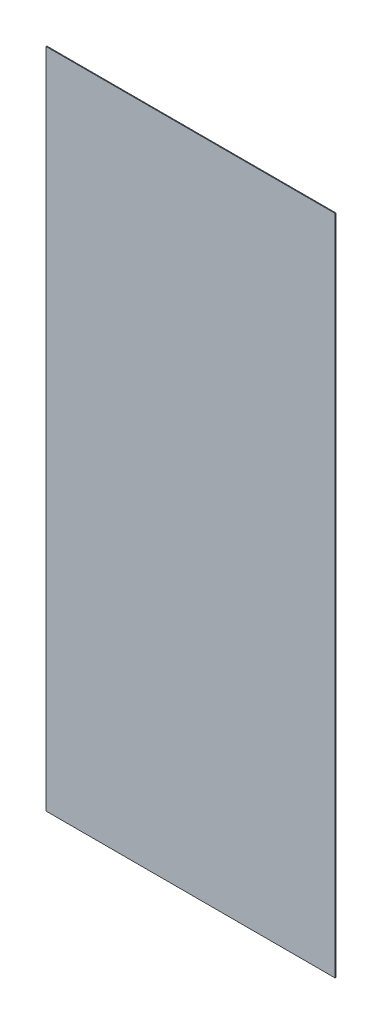
ISO-10303-21;
HEADER;
FILE_DESCRIPTION(('STEP AP214'),'2;1');
FILE_NAME('part.step','',(''),(''),'','','');
FILE_SCHEMA(('AUTOMOTIVE_DESIGN { 1 0 10303 214 1 1 1 1 }'));
ENDSEC;
DATA;
#1=APPLICATION_CONTEXT('core data for automotive mechanical design processes');
#2=APPLICATION_PROTOCOL_DEFINITION('international standard','automotive_design',2000,#1);
#3=PRODUCT_CONTEXT('',#1,'mechanical');
#4=PRODUCT('Part','Part','',(#3));
#5=PRODUCT_RELATED_PRODUCT_CATEGORY('part','',(#4));
#6=PRODUCT_DEFINITION_FORMATION('','',#4);
#7=PRODUCT_DEFINITION_CONTEXT('part definition',#1,'design');
#8=PRODUCT_DEFINITION('design','',#6,#7);
#9=PRODUCT_DEFINITION_SHAPE('','',#8);
#10=(LENGTH_UNIT() NAMED_UNIT(*) SI_UNIT(.MILLI.,.METRE.));
#11=(NAMED_UNIT(*) PLANE_ANGLE_UNIT() SI_UNIT($,.RADIAN.));
#12=(NAMED_UNIT(*) SI_UNIT($,.STERADIAN.) SOLID_ANGLE_UNIT());
#13=UNCERTAINTY_MEASURE_WITH_UNIT(LENGTH_MEASURE(1.E-05),#10,'distance_accuracy_value','');
#14=(GEOMETRIC_REPRESENTATION_CONTEXT(3) GLOBAL_UNCERTAINTY_ASSIGNED_CONTEXT((#13)) GLOBAL_UNIT_ASSIGNED_CONTEXT((#10,
#11,#12)) REPRESENTATION_CONTEXT('',''));
#15=CARTESIAN_POINT('',(0.,0.,0.));
#16=DIRECTION('',(0.,0.,1.));
#17=DIRECTION('',(1.,0.,0.));
#18=AXIS2_PLACEMENT_3D('',#15,#16,#17);
#19=CARTESIAN_POINT('',(0.,0.,1.));
#20=DIRECTION('',(1.,0.,0.));
#21=DIRECTION('',(0.,0.,-1.));
#22=AXIS2_PLACEMENT_3D('',#19,#20,#21);
#23=PLANE('',#22);
#24=DIRECTION('',(0.,-1.,0.));
#25=VECTOR('',#24,1.);
#26=CARTESIAN_POINT('',(0.,0.,0.));
#27=LINE('',#26,#25);
#28=CARTESIAN_POINT('',(0.,820.,0.));
#29=VERTEX_POINT('',#28);
#30=CARTESIAN_POINT('',(0.,0.,0.));
#31=VERTEX_POINT('',#30);
#32=EDGE_CURVE('E95',#29,#31,#27,.T.);
#33=ORIENTED_EDGE('',*,*,#32,.T.);
#34=DIRECTION('',(0.,0.,-1.));
#35=VECTOR('',#34,1.);
#36=CARTESIAN_POINT('',(0.,0.,1.));
#37=LINE('',#36,#35);
#38=CARTESIAN_POINT('',(0.,0.,1.));
#39=VERTEX_POINT('',#38);
#40=EDGE_CURVE('E11',#39,#31,#37,.T.);
#41=ORIENTED_EDGE('',*,*,#40,.F.);
#42=DIRECTION('',(0.,-1.,0.));
#43=VECTOR('',#42,1.);
#44=CARTESIAN_POINT('',(0.,0.,1.));
#45=LINE('',#44,#43);
#46=CARTESIAN_POINT('',(0.,820.,1.));
#47=VERTEX_POINT('',#46);
#48=EDGE_CURVE('E83',#47,#39,#45,.T.);
#49=ORIENTED_EDGE('',*,*,#48,.F.);
#50=DIRECTION('',(0.,0.,-1.));
#51=VECTOR('',#50,1.);
#52=CARTESIAN_POINT('',(0.,820.,1.));
#53=LINE('',#52,#51);
#54=EDGE_CURVE('E91',#47,#29,#53,.T.);
#55=ORIENTED_EDGE('',*,*,#54,.T.);
#56=EDGE_LOOP('',(#33,#41,#49,#55));
#57=FACE_BOUND('',#56,.T.);
#58=ADVANCED_FACE('F32',(#57),#23,.F.);
#59=CARTESIAN_POINT('',(0.,0.,1.));
#60=DIRECTION('',(0.,1.,0.));
#61=DIRECTION('',(0.,0.,1.));
#62=AXIS2_PLACEMENT_3D('',#59,#60,#61);
#63=PLANE('',#62);
#64=DIRECTION('',(1.,0.,0.));
#65=VECTOR('',#64,1.);
#66=CARTESIAN_POINT('',(0.,0.,0.));
#67=LINE('',#66,#65);
#68=CARTESIAN_POINT('',(358.,0.,0.));
#69=VERTEX_POINT('',#68);
#70=EDGE_CURVE('E87',#31,#69,#67,.T.);
#71=ORIENTED_EDGE('',*,*,#70,.T.);
#72=DIRECTION('',(0.,0.,-1.));
#73=VECTOR('',#72,1.);
#74=CARTESIAN_POINT('',(358.,0.,1.));
#75=LINE('',#74,#73);
#76=CARTESIAN_POINT('',(358.,0.,1.));
#77=VERTEX_POINT('',#76);
#78=EDGE_CURVE('E40',#77,#69,#75,.T.);
#79=ORIENTED_EDGE('',*,*,#78,.F.);
#80=DIRECTION('',(1.,0.,0.));
#81=VECTOR('',#80,1.);
#82=CARTESIAN_POINT('',(0.,0.,1.));
#83=LINE('',#82,#81);
#84=EDGE_CURVE('E78',#39,#77,#83,.T.);
#85=ORIENTED_EDGE('',*,*,#84,.F.);
#86=ORIENTED_EDGE('',*,*,#40,.T.);
#87=EDGE_LOOP('',(#71,#79,#85,#86));
#88=FACE_BOUND('',#87,.T.);
#89=ADVANCED_FACE('F86',(#88),#63,.F.);
#90=CARTESIAN_POINT('',(358.,0.,1.));
#91=DIRECTION('',(-1.,0.,0.));
#92=DIRECTION('',(0.,0.,1.));
#93=AXIS2_PLACEMENT_3D('',#90,#91,#92);
#94=PLANE('',#93);
#95=DIRECTION('',(0.,1.,0.));
#96=VECTOR('',#95,1.);
#97=CARTESIAN_POINT('',(358.,0.,0.));
#98=LINE('',#97,#96);
#99=CARTESIAN_POINT('',(358.,820.,0.));
#100=VERTEX_POINT('',#99);
#101=EDGE_CURVE('E65',#69,#100,#98,.T.);
#102=ORIENTED_EDGE('',*,*,#101,.T.);
#103=DIRECTION('',(0.,0.,-1.));
#104=VECTOR('',#103,1.);
#105=CARTESIAN_POINT('',(358.,820.,1.));
#106=LINE('',#105,#104);
#107=CARTESIAN_POINT('',(358.,820.,1.));
#108=VERTEX_POINT('',#107);
#109=EDGE_CURVE('E88',#108,#100,#106,.T.);
#110=ORIENTED_EDGE('',*,*,#109,.F.);
#111=DIRECTION('',(0.,1.,0.));
#112=VECTOR('',#111,1.);
#113=CARTESIAN_POINT('',(358.,0.,1.));
#114=LINE('',#113,#112);
#115=EDGE_CURVE('E81',#77,#108,#114,.T.);
#116=ORIENTED_EDGE('',*,*,#115,.F.);
#117=ORIENTED_EDGE('',*,*,#78,.T.);
#118=EDGE_LOOP('',(#102,#110,#116,#117));
#119=FACE_BOUND('',#118,.T.);
#120=ADVANCED_FACE('F89',(#119),#94,.F.);
#121=CARTESIAN_POINT('',(0.,820.,1.));
#122=DIRECTION('',(0.,-1.,0.));
#123=DIRECTION('',(0.,0.,-1.));
#124=AXIS2_PLACEMENT_3D('',#121,#122,#123);
#125=PLANE('',#124);
#126=DIRECTION('',(-1.,0.,0.));
#127=VECTOR('',#126,1.);
#128=CARTESIAN_POINT('',(0.,820.,0.));
#129=LINE('',#128,#127);
#130=EDGE_CURVE('E71',#100,#29,#129,.T.);
#131=ORIENTED_EDGE('',*,*,#130,.T.);
#132=ORIENTED_EDGE('',*,*,#54,.F.);
#133=DIRECTION('',(-1.,0.,0.));
#134=VECTOR('',#133,1.);
#135=CARTESIAN_POINT('',(0.,820.,1.));
#136=LINE('',#135,#134);
#137=EDGE_CURVE('E48',#108,#47,#136,.T.);
#138=ORIENTED_EDGE('',*,*,#137,.F.);
#139=ORIENTED_EDGE('',*,*,#109,.T.);
#140=EDGE_LOOP('',(#131,#132,#138,#139));
#141=FACE_BOUND('',#140,.T.);
#142=ADVANCED_FACE('F102',(#141),#125,.F.);
#143=CARTESIAN_POINT('',(0.,0.,1.));
#144=DIRECTION('',(0.,0.,-1.));
#145=DIRECTION('',(-1.,0.,0.));
#146=AXIS2_PLACEMENT_3D('',#143,#144,#145);
#147=PLANE('',#146);
#148=ORIENTED_EDGE('',*,*,#48,.T.);
#149=ORIENTED_EDGE('',*,*,#84,.T.);
#150=ORIENTED_EDGE('',*,*,#115,.T.);
#151=ORIENTED_EDGE('',*,*,#137,.T.);
#152=EDGE_LOOP('',(#148,#149,#150,#151));
#153=FACE_BOUND('',#152,.T.);
#154=ADVANCED_FACE('F79',(#153),#147,.F.);
#155=CARTESIAN_POINT('',(0.,0.,0.));
#156=DIRECTION('',(0.,0.,-1.));
#157=DIRECTION('',(-1.,0.,0.));
#158=AXIS2_PLACEMENT_3D('',#155,#156,#157);
#159=PLANE('',#158);
#160=ORIENTED_EDGE('',*,*,#32,.F.);
#161=ORIENTED_EDGE('',*,*,#130,.F.);
#162=ORIENTED_EDGE('',*,*,#101,.F.);
#163=ORIENTED_EDGE('',*,*,#70,.F.);
#164=EDGE_LOOP('',(#160,#161,#162,#163));
#165=FACE_BOUND('',#164,.T.);
#166=ADVANCED_FACE('F105',(#165),#159,.T.);
#167=CLOSED_SHELL('',(#58,#89,#120,#142,#154,#166));
#168=MANIFOLD_SOLID_BREP('B2',#167);
#169=ADVANCED_BREP_SHAPE_REPRESENTATION('',(#18,#168),#14);
#170=SHAPE_DEFINITION_REPRESENTATION(#9,#169);
ENDSEC;
END-ISO-10303-21;
